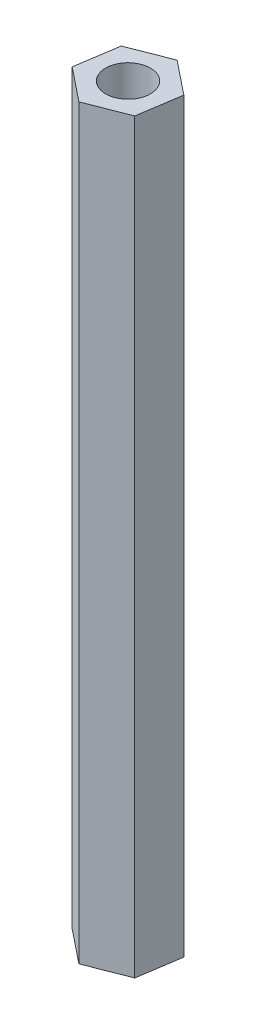
ISO-10303-21;
HEADER;
FILE_DESCRIPTION(('STEP AP214'),'2;1');
FILE_NAME('part.step','',(''),(''),'','','');
FILE_SCHEMA(('AUTOMOTIVE_DESIGN { 1 0 10303 214 1 1 1 1 }'));
ENDSEC;
DATA;
#1=APPLICATION_CONTEXT('core data for automotive mechanical design processes');
#2=APPLICATION_PROTOCOL_DEFINITION('international standard','automotive_design',2000,#1);
#3=PRODUCT_CONTEXT('',#1,'mechanical');
#4=PRODUCT('Part','Part','',(#3));
#5=PRODUCT_RELATED_PRODUCT_CATEGORY('part','',(#4));
#6=PRODUCT_DEFINITION_FORMATION('','',#4);
#7=PRODUCT_DEFINITION_CONTEXT('part definition',#1,'design');
#8=PRODUCT_DEFINITION('design','',#6,#7);
#9=PRODUCT_DEFINITION_SHAPE('','',#8);
#10=(LENGTH_UNIT() NAMED_UNIT(*) SI_UNIT(.MILLI.,.METRE.));
#11=(NAMED_UNIT(*) PLANE_ANGLE_UNIT() SI_UNIT($,.RADIAN.));
#12=(NAMED_UNIT(*) SI_UNIT($,.STERADIAN.) SOLID_ANGLE_UNIT());
#13=UNCERTAINTY_MEASURE_WITH_UNIT(LENGTH_MEASURE(1.E-05),#10,'distance_accuracy_value','');
#14=(GEOMETRIC_REPRESENTATION_CONTEXT(3) GLOBAL_UNCERTAINTY_ASSIGNED_CONTEXT((#13)) GLOBAL_UNIT_ASSIGNED_CONTEXT((#10,
#11,#12)) REPRESENTATION_CONTEXT('',''));
#15=CARTESIAN_POINT('',(0.,0.,0.));
#16=DIRECTION('',(0.,0.,1.));
#17=DIRECTION('',(1.,0.,0.));
#18=AXIS2_PLACEMENT_3D('',#15,#16,#17);
#19=CARTESIAN_POINT('',(0.,50.,0.));
#20=DIRECTION('',(0.,1.,0.));
#21=DIRECTION('',(0.,0.,1.));
#22=AXIS2_PLACEMENT_3D('',#19,#20,#21);
#23=PLANE('',#22);
#24=DIRECTION('',(0.931436185521971,0.,-0.36390470222337));
#25=VECTOR('',#24,1.);
#26=CARTESIAN_POINT('',(-0.434650575551744,50.,2.85384165827501));
#27=LINE('',#26,#25);
#28=CARTESIAN_POINT('',(-0.434650575551744,50.,2.85384165827501));
#29=VERTEX_POINT('',#28);
#30=CARTESIAN_POINT('',(2.2541740866686,50.,1.80333926933485));
#31=VERTEX_POINT('',#30);
#32=EDGE_CURVE('E136',#29,#31,#27,.T.);
#33=ORIENTED_EDGE('',*,*,#32,.T.);
#34=DIRECTION('',(0.150567376078936,0.,-0.988599749777788));
#35=VECTOR('',#34,1.);
#36=CARTESIAN_POINT('',(2.2541740866686,50.,1.80333926933485));
#37=LINE('',#36,#35);
#38=CARTESIAN_POINT('',(2.68882466222034,50.,-1.05050238894017));
#39=VERTEX_POINT('',#38);
#40=EDGE_CURVE('E94',#31,#39,#37,.T.);
#41=ORIENTED_EDGE('',*,*,#40,.T.);
#42=DIRECTION('',(-0.780868809443035,0.,-0.624695047554418));
#43=VECTOR('',#42,1.);
#44=CARTESIAN_POINT('',(2.68882466222034,50.,-1.05050238894017));
#45=LINE('',#44,#43);
#46=CARTESIAN_POINT('',(0.434650575551747,50.,-2.85384165827501));
#47=VERTEX_POINT('',#46);
#48=EDGE_CURVE('E107',#39,#47,#45,.T.);
#49=ORIENTED_EDGE('',*,*,#48,.T.);
#50=DIRECTION('',(-0.931436185521971,0.,0.36390470222337));
#51=VECTOR('',#50,1.);
#52=CARTESIAN_POINT('',(0.434650575551747,50.,-2.85384165827501));
#53=LINE('',#52,#51);
#54=CARTESIAN_POINT('',(-2.2541740866686,50.,-1.80333926933485));
#55=VERTEX_POINT('',#54);
#56=EDGE_CURVE('E101',#47,#55,#53,.T.);
#57=ORIENTED_EDGE('',*,*,#56,.T.);
#58=DIRECTION('',(-0.150567376078936,0.,0.988599749777788));
#59=VECTOR('',#58,1.);
#60=CARTESIAN_POINT('',(-2.2541740866686,50.,-1.80333926933485));
#61=LINE('',#60,#59);
#62=CARTESIAN_POINT('',(-2.68882466222034,50.,1.05050238894017));
#63=VERTEX_POINT('',#62);
#64=EDGE_CURVE('E105',#55,#63,#61,.T.);
#65=ORIENTED_EDGE('',*,*,#64,.T.);
#66=DIRECTION('',(0.780868809443036,0.,0.624695047554418));
#67=VECTOR('',#66,1.);
#68=CARTESIAN_POINT('',(-2.68882466222034,50.,1.05050238894017));
#69=LINE('',#68,#67);
#70=EDGE_CURVE('E57',#63,#29,#69,.T.);
#71=ORIENTED_EDGE('',*,*,#70,.T.);
#72=EDGE_LOOP('',(#33,#41,#49,#57,#65,#71));
#73=FACE_BOUND('',#72,.T.);
#74=CARTESIAN_POINT('',(0.,50.,0.));
#75=DIRECTION('',(0.,1.,0.));
#76=DIRECTION('',(0.,0.,1.));
#77=AXIS2_PLACEMENT_3D('',#74,#75,#76);
#78=CIRCLE('',#77,1.5);
#79=CARTESIAN_POINT('',(0.,50.,1.5));
#80=VERTEX_POINT('',#79);
#81=EDGE_CURVE('E129',#80,#80,#78,.T.);
#82=ORIENTED_EDGE('',*,*,#81,.F.);
#83=EDGE_LOOP('',(#82));
#84=FACE_BOUND('',#83,.T.);
#85=ADVANCED_FACE('F40',(#73,#84),#23,.T.);
#86=CARTESIAN_POINT('',(0.,0.,0.));
#87=DIRECTION('',(0.,1.,0.));
#88=DIRECTION('',(0.,0.,1.));
#89=AXIS2_PLACEMENT_3D('',#86,#87,#88);
#90=PLANE('',#89);
#91=DIRECTION('',(0.931436185521971,0.,-0.36390470222337));
#92=VECTOR('',#91,1.);
#93=CARTESIAN_POINT('',(-0.434650575551744,0.,2.85384165827501));
#94=LINE('',#93,#92);
#95=CARTESIAN_POINT('',(-0.434650575551744,0.,2.85384165827501));
#96=VERTEX_POINT('',#95);
#97=CARTESIAN_POINT('',(2.2541740866686,0.,1.80333926933485));
#98=VERTEX_POINT('',#97);
#99=EDGE_CURVE('E125',#96,#98,#94,.T.);
#100=ORIENTED_EDGE('',*,*,#99,.F.);
#101=DIRECTION('',(0.780868809443036,0.,0.624695047554418));
#102=VECTOR('',#101,1.);
#103=CARTESIAN_POINT('',(-2.68882466222034,0.,1.05050238894017));
#104=LINE('',#103,#102);
#105=CARTESIAN_POINT('',(-2.68882466222034,0.,1.05050238894017));
#106=VERTEX_POINT('',#105);
#107=EDGE_CURVE('E86',#106,#96,#104,.T.);
#108=ORIENTED_EDGE('',*,*,#107,.F.);
#109=DIRECTION('',(-0.150567376078936,0.,0.988599749777788));
#110=VECTOR('',#109,1.);
#111=CARTESIAN_POINT('',(-2.2541740866686,0.,-1.80333926933485));
#112=LINE('',#111,#110);
#113=CARTESIAN_POINT('',(-2.2541740866686,0.,-1.80333926933485));
#114=VERTEX_POINT('',#113);
#115=EDGE_CURVE('E80',#114,#106,#112,.T.);
#116=ORIENTED_EDGE('',*,*,#115,.F.);
#117=DIRECTION('',(-0.931436185521971,0.,0.36390470222337));
#118=VECTOR('',#117,1.);
#119=CARTESIAN_POINT('',(0.434650575551747,0.,-2.85384165827501));
#120=LINE('',#119,#118);
#121=CARTESIAN_POINT('',(0.434650575551747,0.,-2.85384165827501));
#122=VERTEX_POINT('',#121);
#123=EDGE_CURVE('E115',#122,#114,#120,.T.);
#124=ORIENTED_EDGE('',*,*,#123,.F.);
#125=DIRECTION('',(-0.780868809443035,0.,-0.624695047554418));
#126=VECTOR('',#125,1.);
#127=CARTESIAN_POINT('',(2.68882466222034,0.,-1.05050238894017));
#128=LINE('',#127,#126);
#129=CARTESIAN_POINT('',(2.68882466222034,0.,-1.05050238894017));
#130=VERTEX_POINT('',#129);
#131=EDGE_CURVE('E131',#130,#122,#128,.T.);
#132=ORIENTED_EDGE('',*,*,#131,.F.);
#133=DIRECTION('',(0.150567376078936,0.,-0.988599749777788));
#134=VECTOR('',#133,1.);
#135=CARTESIAN_POINT('',(2.2541740866686,0.,1.80333926933485));
#136=LINE('',#135,#134);
#137=EDGE_CURVE('E128',#98,#130,#136,.T.);
#138=ORIENTED_EDGE('',*,*,#137,.F.);
#139=EDGE_LOOP('',(#100,#108,#116,#124,#132,#138));
#140=FACE_BOUND('',#139,.T.);
#141=CARTESIAN_POINT('',(0.,0.,0.));
#142=DIRECTION('',(0.,1.,0.));
#143=DIRECTION('',(0.,0.,1.));
#144=AXIS2_PLACEMENT_3D('',#141,#142,#143);
#145=CIRCLE('',#144,1.5);
#146=CARTESIAN_POINT('',(0.,0.,1.5));
#147=VERTEX_POINT('',#146);
#148=EDGE_CURVE('E247',#147,#147,#145,.T.);
#149=ORIENTED_EDGE('',*,*,#148,.T.);
#150=EDGE_LOOP('',(#149));
#151=FACE_BOUND('',#150,.T.);
#152=ADVANCED_FACE('F145',(#140,#151),#90,.F.);
#153=CARTESIAN_POINT('',(-0.434650575551744,50.,2.85384165827501));
#154=DIRECTION('',(-0.36390470222337,0.,-0.931436185521972));
#155=DIRECTION('',(-0.931436185521972,0.,0.36390470222337));
#156=AXIS2_PLACEMENT_3D('',#153,#154,#155);
#157=PLANE('',#156);
#158=ORIENTED_EDGE('',*,*,#99,.T.);
#159=DIRECTION('',(0.,-1.,0.));
#160=VECTOR('',#159,1.);
#161=CARTESIAN_POINT('',(2.2541740866686,50.,1.80333926933485));
#162=LINE('',#161,#160);
#163=EDGE_CURVE('E11',#31,#98,#162,.T.);
#164=ORIENTED_EDGE('',*,*,#163,.F.);
#165=ORIENTED_EDGE('',*,*,#32,.F.);
#166=DIRECTION('',(0.,-1.,0.));
#167=VECTOR('',#166,1.);
#168=CARTESIAN_POINT('',(-0.434650575551744,50.,2.85384165827501));
#169=LINE('',#168,#167);
#170=EDGE_CURVE('E121',#29,#96,#169,.T.);
#171=ORIENTED_EDGE('',*,*,#170,.T.);
#172=EDGE_LOOP('',(#158,#164,#165,#171));
#173=FACE_BOUND('',#172,.T.);
#174=ADVANCED_FACE('F42',(#173),#157,.F.);
#175=CARTESIAN_POINT('',(2.2541740866686,50.,1.80333926933485));
#176=DIRECTION('',(-0.988599749777788,0.,-0.150567376078936));
#177=DIRECTION('',(-0.150567376078936,0.,0.988599749777788));
#178=AXIS2_PLACEMENT_3D('',#175,#176,#177);
#179=PLANE('',#178);
#180=ORIENTED_EDGE('',*,*,#137,.T.);
#181=DIRECTION('',(0.,-1.,0.));
#182=VECTOR('',#181,1.);
#183=CARTESIAN_POINT('',(2.68882466222034,50.,-1.05050238894017));
#184=LINE('',#183,#182);
#185=EDGE_CURVE('E49',#39,#130,#184,.T.);
#186=ORIENTED_EDGE('',*,*,#185,.F.);
#187=ORIENTED_EDGE('',*,*,#40,.F.);
#188=ORIENTED_EDGE('',*,*,#163,.T.);
#189=EDGE_LOOP('',(#180,#186,#187,#188));
#190=FACE_BOUND('',#189,.T.);
#191=ADVANCED_FACE('F170',(#190),#179,.F.);
#192=CARTESIAN_POINT('',(2.68882466222034,50.,-1.05050238894017));
#193=DIRECTION('',(-0.624695047554418,0.,0.780868809443035));
#194=DIRECTION('',(0.780868809443035,0.,0.624695047554418));
#195=AXIS2_PLACEMENT_3D('',#192,#193,#194);
#196=PLANE('',#195);
#197=ORIENTED_EDGE('',*,*,#131,.T.);
#198=DIRECTION('',(0.,-1.,0.));
#199=VECTOR('',#198,1.);
#200=CARTESIAN_POINT('',(0.434650575551747,50.,-2.85384165827501));
#201=LINE('',#200,#199);
#202=EDGE_CURVE('E116',#47,#122,#201,.T.);
#203=ORIENTED_EDGE('',*,*,#202,.F.);
#204=ORIENTED_EDGE('',*,*,#48,.F.);
#205=ORIENTED_EDGE('',*,*,#185,.T.);
#206=EDGE_LOOP('',(#197,#203,#204,#205));
#207=FACE_BOUND('',#206,.T.);
#208=ADVANCED_FACE('F142',(#207),#196,.F.);
#209=CARTESIAN_POINT('',(0.434650575551747,50.,-2.85384165827501));
#210=DIRECTION('',(0.36390470222337,0.,0.931436185521972));
#211=DIRECTION('',(0.931436185521972,0.,-0.36390470222337));
#212=AXIS2_PLACEMENT_3D('',#209,#210,#211);
#213=PLANE('',#212);
#214=ORIENTED_EDGE('',*,*,#123,.T.);
#215=DIRECTION('',(0.,-1.,0.));
#216=VECTOR('',#215,1.);
#217=CARTESIAN_POINT('',(-2.2541740866686,50.,-1.80333926933485));
#218=LINE('',#217,#216);
#219=EDGE_CURVE('E112',#55,#114,#218,.T.);
#220=ORIENTED_EDGE('',*,*,#219,.F.);
#221=ORIENTED_EDGE('',*,*,#56,.F.);
#222=ORIENTED_EDGE('',*,*,#202,.T.);
#223=EDGE_LOOP('',(#214,#220,#221,#222));
#224=FACE_BOUND('',#223,.T.);
#225=ADVANCED_FACE('F113',(#224),#213,.F.);
#226=CARTESIAN_POINT('',(-2.2541740866686,50.,-1.80333926933485));
#227=DIRECTION('',(0.988599749777788,0.,0.150567376078936));
#228=DIRECTION('',(0.150567376078936,0.,-0.988599749777788));
#229=AXIS2_PLACEMENT_3D('',#226,#227,#228);
#230=PLANE('',#229);
#231=ORIENTED_EDGE('',*,*,#115,.T.);
#232=DIRECTION('',(0.,-1.,0.));
#233=VECTOR('',#232,1.);
#234=CARTESIAN_POINT('',(-2.68882466222034,50.,1.05050238894017));
#235=LINE('',#234,#233);
#236=EDGE_CURVE('E117',#63,#106,#235,.T.);
#237=ORIENTED_EDGE('',*,*,#236,.F.);
#238=ORIENTED_EDGE('',*,*,#64,.F.);
#239=ORIENTED_EDGE('',*,*,#219,.T.);
#240=EDGE_LOOP('',(#231,#237,#238,#239));
#241=FACE_BOUND('',#240,.T.);
#242=ADVANCED_FACE('F119',(#241),#230,.F.);
#243=CARTESIAN_POINT('',(-2.68882466222034,50.,1.05050238894017));
#244=DIRECTION('',(0.624695047554418,0.,-0.780868809443036));
#245=DIRECTION('',(-0.780868809443036,0.,-0.624695047554418));
#246=AXIS2_PLACEMENT_3D('',#243,#244,#245);
#247=PLANE('',#246);
#248=ORIENTED_EDGE('',*,*,#107,.T.);
#249=ORIENTED_EDGE('',*,*,#170,.F.);
#250=ORIENTED_EDGE('',*,*,#70,.F.);
#251=ORIENTED_EDGE('',*,*,#236,.T.);
#252=EDGE_LOOP('',(#248,#249,#250,#251));
#253=FACE_BOUND('',#252,.T.);
#254=ADVANCED_FACE('F150',(#253),#247,.F.);
#255=CARTESIAN_POINT('',(0.,50.,0.));
#256=DIRECTION('',(0.,-1.,0.));
#257=DIRECTION('',(0.,0.,-1.));
#258=AXIS2_PLACEMENT_3D('',#255,#256,#257);
#259=CYLINDRICAL_SURFACE('',#258,1.5);
#260=ORIENTED_EDGE('',*,*,#81,.T.);
#261=EDGE_LOOP('',(#260));
#262=FACE_BOUND('',#261,.T.);
#263=ORIENTED_EDGE('',*,*,#148,.F.);
#264=EDGE_LOOP('',(#263));
#265=FACE_BOUND('',#264,.T.);
#266=ADVANCED_FACE('F152',(#262,#265),#259,.F.);
#267=CLOSED_SHELL('',(#85,#152,#174,#191,#208,#225,#242,#254,#266));
#268=MANIFOLD_SOLID_BREP('B2',#267);
#269=ADVANCED_BREP_SHAPE_REPRESENTATION('',(#18,#268),#14);
#270=SHAPE_DEFINITION_REPRESENTATION(#9,#269);
ENDSEC;
END-ISO-10303-21;
